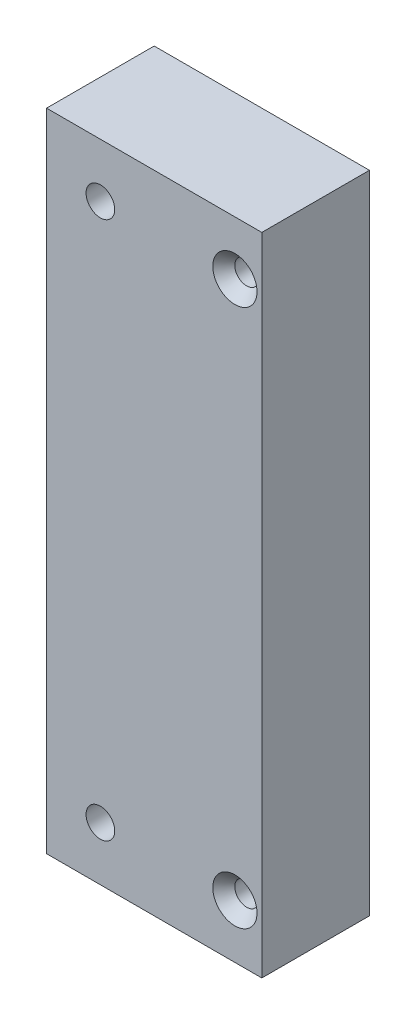
ISO-10303-21;
HEADER;
FILE_DESCRIPTION(('STEP AP214'),'2;1');
FILE_NAME('part.step','',(''),(''),'','','');
FILE_SCHEMA(('AUTOMOTIVE_DESIGN { 1 0 10303 214 1 1 1 1 }'));
ENDSEC;
DATA;
#1=APPLICATION_CONTEXT('core data for automotive mechanical design processes');
#2=APPLICATION_PROTOCOL_DEFINITION('international standard','automotive_design',2000,#1);
#3=PRODUCT_CONTEXT('',#1,'mechanical');
#4=PRODUCT('Part','Part','',(#3));
#5=PRODUCT_RELATED_PRODUCT_CATEGORY('part','',(#4));
#6=PRODUCT_DEFINITION_FORMATION('','',#4);
#7=PRODUCT_DEFINITION_CONTEXT('part definition',#1,'design');
#8=PRODUCT_DEFINITION('design','',#6,#7);
#9=PRODUCT_DEFINITION_SHAPE('','',#8);
#10=(LENGTH_UNIT() NAMED_UNIT(*) SI_UNIT(.MILLI.,.METRE.));
#11=(NAMED_UNIT(*) PLANE_ANGLE_UNIT() SI_UNIT($,.RADIAN.));
#12=(NAMED_UNIT(*) SI_UNIT($,.STERADIAN.) SOLID_ANGLE_UNIT());
#13=UNCERTAINTY_MEASURE_WITH_UNIT(LENGTH_MEASURE(1.E-05),#10,'distance_accuracy_value','');
#14=(GEOMETRIC_REPRESENTATION_CONTEXT(3) GLOBAL_UNCERTAINTY_ASSIGNED_CONTEXT((#13)) GLOBAL_UNIT_ASSIGNED_CONTEXT((#10,
#11,#12)) REPRESENTATION_CONTEXT('',''));
#15=CARTESIAN_POINT('',(0.,0.,0.));
#16=DIRECTION('',(0.,0.,1.));
#17=DIRECTION('',(1.,0.,0.));
#18=AXIS2_PLACEMENT_3D('',#15,#16,#17);
#19=CARTESIAN_POINT('',(0.,0.,25.4));
#20=DIRECTION('',(0.,0.,1.));
#21=DIRECTION('',(1.,0.,0.));
#22=AXIS2_PLACEMENT_3D('',#19,#20,#21);
#23=PLANE('',#22);
#24=CARTESIAN_POINT('',(349.25,304.8,25.4));
#25=DIRECTION('',(0.,0.,1.));
#26=DIRECTION('',(1.,0.,0.));
#27=AXIS2_PLACEMENT_3D('',#24,#25,#26);
#28=CIRCLE('',#27,5.21969999999999);
#29=CARTESIAN_POINT('',(354.4697,304.8,25.4));
#30=VERTEX_POINT('',#29);
#31=EDGE_CURVE('E138',#30,#30,#28,.T.);
#32=ORIENTED_EDGE('',*,*,#31,.F.);
#33=EDGE_LOOP('',(#32));
#34=FACE_BOUND('',#33,.T.);
#35=CARTESIAN_POINT('',(349.25,177.8,25.4));
#36=DIRECTION('',(0.,0.,1.));
#37=DIRECTION('',(1.,0.,0.));
#38=AXIS2_PLACEMENT_3D('',#35,#36,#37);
#39=CIRCLE('',#38,5.21969999999999);
#40=CARTESIAN_POINT('',(354.4697,177.8,25.4));
#41=VERTEX_POINT('',#40);
#42=EDGE_CURVE('E129',#41,#41,#39,.T.);
#43=ORIENTED_EDGE('',*,*,#42,.F.);
#44=EDGE_LOOP('',(#43));
#45=FACE_BOUND('',#44,.T.);
#46=CARTESIAN_POINT('',(317.5,304.8,25.4));
#47=DIRECTION('',(0.,0.,1.));
#48=DIRECTION('',(1.,0.,0.));
#49=AXIS2_PLACEMENT_3D('',#46,#47,#48);
#50=CIRCLE('',#49,3.37819999999999);
#51=CARTESIAN_POINT('',(320.8782,304.8,25.4));
#52=VERTEX_POINT('',#51);
#53=EDGE_CURVE('E100',#52,#52,#50,.T.);
#54=ORIENTED_EDGE('',*,*,#53,.F.);
#55=EDGE_LOOP('',(#54));
#56=FACE_BOUND('',#55,.T.);
#57=DIRECTION('',(1.,0.,0.));
#58=VECTOR('',#57,1.);
#59=CARTESIAN_POINT('',(355.6,165.1,25.4));
#60=LINE('',#59,#58);
#61=CARTESIAN_POINT('',(304.8,165.1,25.4));
#62=VERTEX_POINT('',#61);
#63=CARTESIAN_POINT('',(355.6,165.1,25.4));
#64=VERTEX_POINT('',#63);
#65=EDGE_CURVE('E85',#62,#64,#60,.T.);
#66=ORIENTED_EDGE('',*,*,#65,.T.);
#67=DIRECTION('',(0.,1.,0.));
#68=VECTOR('',#67,1.);
#69=CARTESIAN_POINT('',(355.6,165.1,25.4));
#70=LINE('',#69,#68);
#71=CARTESIAN_POINT('',(355.6,317.5,25.4));
#72=VERTEX_POINT('',#71);
#73=EDGE_CURVE('E80',#64,#72,#70,.T.);
#74=ORIENTED_EDGE('',*,*,#73,.T.);
#75=DIRECTION('',(-1.,0.,0.));
#76=VECTOR('',#75,1.);
#77=CARTESIAN_POINT('',(355.6,317.5,25.4));
#78=LINE('',#77,#76);
#79=CARTESIAN_POINT('',(304.8,317.5,25.4));
#80=VERTEX_POINT('',#79);
#81=EDGE_CURVE('E83',#72,#80,#78,.T.);
#82=ORIENTED_EDGE('',*,*,#81,.T.);
#83=DIRECTION('',(0.,-1.,0.));
#84=VECTOR('',#83,1.);
#85=CARTESIAN_POINT('',(304.8,317.5,25.4));
#86=LINE('',#85,#84);
#87=EDGE_CURVE('E50',#80,#62,#86,.T.);
#88=ORIENTED_EDGE('',*,*,#87,.T.);
#89=EDGE_LOOP('',(#66,#74,#82,#88));
#90=FACE_BOUND('',#89,.T.);
#91=CARTESIAN_POINT('',(317.5,177.8,25.4));
#92=DIRECTION('',(0.,0.,1.));
#93=DIRECTION('',(1.,0.,0.));
#94=AXIS2_PLACEMENT_3D('',#91,#92,#93);
#95=CIRCLE('',#94,3.37819999999999);
#96=CARTESIAN_POINT('',(320.8782,177.8,25.4));
#97=VERTEX_POINT('',#96);
#98=EDGE_CURVE('E115',#97,#97,#95,.T.);
#99=ORIENTED_EDGE('',*,*,#98,.F.);
#100=EDGE_LOOP('',(#99));
#101=FACE_BOUND('',#100,.T.);
#102=ADVANCED_FACE('F33',(#34,#45,#56,#90,#101),#23,.T.);
#103=CARTESIAN_POINT('',(0.,0.,0.));
#104=DIRECTION('',(0.,0.,1.));
#105=DIRECTION('',(1.,0.,0.));
#106=AXIS2_PLACEMENT_3D('',#103,#104,#105);
#107=PLANE('',#106);
#108=CARTESIAN_POINT('',(349.25,304.8,0.));
#109=DIRECTION('',(0.,0.,1.));
#110=DIRECTION('',(1.,0.,0.));
#111=AXIS2_PLACEMENT_3D('',#108,#109,#110);
#112=CIRCLE('',#111,2.8067);
#113=CARTESIAN_POINT('',(352.0567,304.8,0.));
#114=VERTEX_POINT('',#113);
#115=EDGE_CURVE('E132',#114,#114,#112,.T.);
#116=ORIENTED_EDGE('',*,*,#115,.T.);
#117=EDGE_LOOP('',(#116));
#118=FACE_BOUND('',#117,.T.);
#119=CARTESIAN_POINT('',(349.25,177.8,0.));
#120=DIRECTION('',(0.,0.,1.));
#121=DIRECTION('',(1.,0.,0.));
#122=AXIS2_PLACEMENT_3D('',#119,#120,#121);
#123=CIRCLE('',#122,2.8067);
#124=CARTESIAN_POINT('',(352.0567,177.8,0.));
#125=VERTEX_POINT('',#124);
#126=EDGE_CURVE('E121',#125,#125,#123,.T.);
#127=ORIENTED_EDGE('',*,*,#126,.T.);
#128=EDGE_LOOP('',(#127));
#129=FACE_BOUND('',#128,.T.);
#130=DIRECTION('',(1.,0.,0.));
#131=VECTOR('',#130,1.);
#132=CARTESIAN_POINT('',(355.6,165.1,0.));
#133=LINE('',#132,#131);
#134=CARTESIAN_POINT('',(304.8,165.1,0.));
#135=VERTEX_POINT('',#134);
#136=CARTESIAN_POINT('',(355.6,165.1,0.));
#137=VERTEX_POINT('',#136);
#138=EDGE_CURVE('E97',#135,#137,#133,.T.);
#139=ORIENTED_EDGE('',*,*,#138,.F.);
#140=DIRECTION('',(0.,-1.,0.));
#141=VECTOR('',#140,1.);
#142=CARTESIAN_POINT('',(304.8,317.5,0.));
#143=LINE('',#142,#141);
#144=CARTESIAN_POINT('',(304.8,317.5,0.));
#145=VERTEX_POINT('',#144);
#146=EDGE_CURVE('E73',#145,#135,#143,.T.);
#147=ORIENTED_EDGE('',*,*,#146,.F.);
#148=DIRECTION('',(-1.,0.,0.));
#149=VECTOR('',#148,1.);
#150=CARTESIAN_POINT('',(355.6,317.5,0.));
#151=LINE('',#150,#149);
#152=CARTESIAN_POINT('',(355.6,317.5,0.));
#153=VERTEX_POINT('',#152);
#154=EDGE_CURVE('E67',#153,#145,#151,.T.);
#155=ORIENTED_EDGE('',*,*,#154,.F.);
#156=DIRECTION('',(0.,1.,0.));
#157=VECTOR('',#156,1.);
#158=CARTESIAN_POINT('',(355.6,165.1,0.));
#159=LINE('',#158,#157);
#160=EDGE_CURVE('E89',#137,#153,#159,.T.);
#161=ORIENTED_EDGE('',*,*,#160,.F.);
#162=EDGE_LOOP('',(#139,#147,#155,#161));
#163=FACE_BOUND('',#162,.T.);
#164=CARTESIAN_POINT('',(317.5,304.8,0.));
#165=DIRECTION('',(0.,0.,1.));
#166=DIRECTION('',(1.,0.,0.));
#167=AXIS2_PLACEMENT_3D('',#164,#165,#166);
#168=CIRCLE('',#167,3.37819999999999);
#169=CARTESIAN_POINT('',(320.8782,304.8,0.));
#170=VERTEX_POINT('',#169);
#171=EDGE_CURVE('E112',#170,#170,#168,.T.);
#172=ORIENTED_EDGE('',*,*,#171,.T.);
#173=EDGE_LOOP('',(#172));
#174=FACE_BOUND('',#173,.T.);
#175=CARTESIAN_POINT('',(317.5,177.8,0.));
#176=DIRECTION('',(0.,0.,1.));
#177=DIRECTION('',(1.,0.,0.));
#178=AXIS2_PLACEMENT_3D('',#175,#176,#177);
#179=CIRCLE('',#178,3.37819999999999);
#180=CARTESIAN_POINT('',(320.8782,177.8,0.));
#181=VERTEX_POINT('',#180);
#182=EDGE_CURVE('E118',#181,#181,#179,.T.);
#183=ORIENTED_EDGE('',*,*,#182,.T.);
#184=EDGE_LOOP('',(#183));
#185=FACE_BOUND('',#184,.T.);
#186=ADVANCED_FACE('F108',(#118,#129,#163,#174,#185),#107,.F.);
#187=CARTESIAN_POINT('',(355.6,165.1,25.4));
#188=DIRECTION('',(0.,1.,0.));
#189=DIRECTION('',(-1.,0.,0.));
#190=AXIS2_PLACEMENT_3D('',#187,#188,#189);
#191=PLANE('',#190);
#192=ORIENTED_EDGE('',*,*,#138,.T.);
#193=DIRECTION('',(0.,0.,-1.));
#194=VECTOR('',#193,1.);
#195=CARTESIAN_POINT('',(355.6,165.1,25.4));
#196=LINE('',#195,#194);
#197=EDGE_CURVE('E11',#64,#137,#196,.T.);
#198=ORIENTED_EDGE('',*,*,#197,.F.);
#199=ORIENTED_EDGE('',*,*,#65,.F.);
#200=DIRECTION('',(0.,0.,-1.));
#201=VECTOR('',#200,1.);
#202=CARTESIAN_POINT('',(304.8,165.1,25.4));
#203=LINE('',#202,#201);
#204=EDGE_CURVE('E93',#62,#135,#203,.T.);
#205=ORIENTED_EDGE('',*,*,#204,.T.);
#206=EDGE_LOOP('',(#192,#198,#199,#205));
#207=FACE_BOUND('',#206,.T.);
#208=ADVANCED_FACE('F35',(#207),#191,.F.);
#209=CARTESIAN_POINT('',(355.6,165.1,25.4));
#210=DIRECTION('',(-1.,0.,0.));
#211=DIRECTION('',(0.,0.,1.));
#212=AXIS2_PLACEMENT_3D('',#209,#210,#211);
#213=PLANE('',#212);
#214=ORIENTED_EDGE('',*,*,#160,.T.);
#215=DIRECTION('',(0.,0.,-1.));
#216=VECTOR('',#215,1.);
#217=CARTESIAN_POINT('',(355.6,317.5,25.4));
#218=LINE('',#217,#216);
#219=EDGE_CURVE('E42',#72,#153,#218,.T.);
#220=ORIENTED_EDGE('',*,*,#219,.F.);
#221=ORIENTED_EDGE('',*,*,#73,.F.);
#222=ORIENTED_EDGE('',*,*,#197,.T.);
#223=EDGE_LOOP('',(#214,#220,#221,#222));
#224=FACE_BOUND('',#223,.T.);
#225=ADVANCED_FACE('F88',(#224),#213,.F.);
#226=CARTESIAN_POINT('',(355.6,317.5,25.4));
#227=DIRECTION('',(0.,-1.,0.));
#228=DIRECTION('',(1.,0.,0.));
#229=AXIS2_PLACEMENT_3D('',#226,#227,#228);
#230=PLANE('',#229);
#231=ORIENTED_EDGE('',*,*,#154,.T.);
#232=DIRECTION('',(0.,0.,-1.));
#233=VECTOR('',#232,1.);
#234=CARTESIAN_POINT('',(304.8,317.5,25.4));
#235=LINE('',#234,#233);
#236=EDGE_CURVE('E90',#80,#145,#235,.T.);
#237=ORIENTED_EDGE('',*,*,#236,.F.);
#238=ORIENTED_EDGE('',*,*,#81,.F.);
#239=ORIENTED_EDGE('',*,*,#219,.T.);
#240=EDGE_LOOP('',(#231,#237,#238,#239));
#241=FACE_BOUND('',#240,.T.);
#242=ADVANCED_FACE('F91',(#241),#230,.F.);
#243=CARTESIAN_POINT('',(304.8,317.5,25.4));
#244=DIRECTION('',(1.,0.,0.));
#245=DIRECTION('',(0.,0.,-1.));
#246=AXIS2_PLACEMENT_3D('',#243,#244,#245);
#247=PLANE('',#246);
#248=ORIENTED_EDGE('',*,*,#146,.T.);
#249=ORIENTED_EDGE('',*,*,#204,.F.);
#250=ORIENTED_EDGE('',*,*,#87,.F.);
#251=ORIENTED_EDGE('',*,*,#236,.T.);
#252=EDGE_LOOP('',(#248,#249,#250,#251));
#253=FACE_BOUND('',#252,.T.);
#254=ADVANCED_FACE('F105',(#253),#247,.F.);
#255=CARTESIAN_POINT('',(317.5,304.8,25.4));
#256=DIRECTION('',(0.,0.,-1.));
#257=DIRECTION('',(-1.,0.,0.));
#258=AXIS2_PLACEMENT_3D('',#255,#256,#257);
#259=CYLINDRICAL_SURFACE('',#258,3.37819999999999);
#260=ORIENTED_EDGE('',*,*,#53,.T.);
#261=EDGE_LOOP('',(#260));
#262=FACE_BOUND('',#261,.T.);
#263=ORIENTED_EDGE('',*,*,#171,.F.);
#264=EDGE_LOOP('',(#263));
#265=FACE_BOUND('',#264,.T.);
#266=ADVANCED_FACE('F151',(#262,#265),#259,.F.);
#267=CARTESIAN_POINT('',(317.5,177.8,25.4));
#268=DIRECTION('',(0.,0.,-1.));
#269=DIRECTION('',(-1.,0.,0.));
#270=AXIS2_PLACEMENT_3D('',#267,#268,#269);
#271=CYLINDRICAL_SURFACE('',#270,3.37819999999999);
#272=ORIENTED_EDGE('',*,*,#98,.T.);
#273=EDGE_LOOP('',(#272));
#274=FACE_BOUND('',#273,.T.);
#275=ORIENTED_EDGE('',*,*,#182,.F.);
#276=EDGE_LOOP('',(#275));
#277=FACE_BOUND('',#276,.T.);
#278=ADVANCED_FACE('F154',(#274,#277),#271,.F.);
#279=CARTESIAN_POINT('',(349.25,177.8,25.4));
#280=DIRECTION('',(0.,0.,1.));
#281=DIRECTION('',(1.,0.,0.));
#282=AXIS2_PLACEMENT_3D('',#279,#280,#281);
#283=CYLINDRICAL_SURFACE('',#282,2.8067);
#284=ORIENTED_EDGE('',*,*,#126,.F.);
#285=EDGE_LOOP('',(#284));
#286=FACE_BOUND('',#285,.T.);
#287=CARTESIAN_POINT('',(349.25,177.8,22.6241610333757));
#288=DIRECTION('',(0.,0.,1.));
#289=DIRECTION('',(1.,0.,0.));
#290=AXIS2_PLACEMENT_3D('',#287,#288,#289);
#291=CIRCLE('',#290,2.8067);
#292=CARTESIAN_POINT('',(352.0567,177.8,22.6241610333757));
#293=VERTEX_POINT('',#292);
#294=EDGE_CURVE('E126',#293,#293,#291,.T.);
#295=ORIENTED_EDGE('',*,*,#294,.T.);
#296=EDGE_LOOP('',(#295));
#297=FACE_BOUND('',#296,.T.);
#298=ADVANCED_FACE('F164',(#286,#297),#283,.F.);
#299=CARTESIAN_POINT('',(349.25,177.8,25.4));
#300=DIRECTION('',(0.,0.,1.));
#301=DIRECTION('',(1.,0.,0.));
#302=AXIS2_PLACEMENT_3D('',#299,#300,#301);
#303=CONICAL_SURFACE('',#302,5.21969999999999,0.715584993317673);
#304=ORIENTED_EDGE('',*,*,#294,.F.);
#305=EDGE_LOOP('',(#304));
#306=FACE_BOUND('',#305,.T.);
#307=ORIENTED_EDGE('',*,*,#42,.T.);
#308=EDGE_LOOP('',(#307));
#309=FACE_BOUND('',#308,.T.);
#310=ADVANCED_FACE('F170',(#306,#309),#303,.F.);
#311=CARTESIAN_POINT('',(349.25,304.8,25.4));
#312=DIRECTION('',(0.,0.,1.));
#313=DIRECTION('',(1.,0.,0.));
#314=AXIS2_PLACEMENT_3D('',#311,#312,#313);
#315=CYLINDRICAL_SURFACE('',#314,2.8067);
#316=ORIENTED_EDGE('',*,*,#115,.F.);
#317=EDGE_LOOP('',(#316));
#318=FACE_BOUND('',#317,.T.);
#319=CARTESIAN_POINT('',(349.25,304.8,22.6241610333757));
#320=DIRECTION('',(0.,0.,1.));
#321=DIRECTION('',(1.,0.,0.));
#322=AXIS2_PLACEMENT_3D('',#319,#320,#321);
#323=CIRCLE('',#322,2.8067);
#324=CARTESIAN_POINT('',(352.0567,304.8,22.6241610333757));
#325=VERTEX_POINT('',#324);
#326=EDGE_CURVE('E135',#325,#325,#323,.T.);
#327=ORIENTED_EDGE('',*,*,#326,.T.);
#328=EDGE_LOOP('',(#327));
#329=FACE_BOUND('',#328,.T.);
#330=ADVANCED_FACE('F237',(#318,#329),#315,.F.);
#331=CARTESIAN_POINT('',(349.25,304.8,25.4));
#332=DIRECTION('',(0.,0.,1.));
#333=DIRECTION('',(1.,0.,0.));
#334=AXIS2_PLACEMENT_3D('',#331,#332,#333);
#335=CONICAL_SURFACE('',#334,5.21969999999999,0.715584993317673);
#336=ORIENTED_EDGE('',*,*,#326,.F.);
#337=EDGE_LOOP('',(#336));
#338=FACE_BOUND('',#337,.T.);
#339=ORIENTED_EDGE('',*,*,#31,.T.);
#340=EDGE_LOOP('',(#339));
#341=FACE_BOUND('',#340,.T.);
#342=ADVANCED_FACE('F142',(#338,#341),#335,.F.);
#343=CLOSED_SHELL('',(#102,#186,#208,#225,#242,#254,#266,#278,#298,#310,#330,#342));
#344=MANIFOLD_SOLID_BREP('B2',#343);
#345=ADVANCED_BREP_SHAPE_REPRESENTATION('',(#18,#344),#14);
#346=SHAPE_DEFINITION_REPRESENTATION(#9,#345);
ENDSEC;
END-ISO-10303-21;
